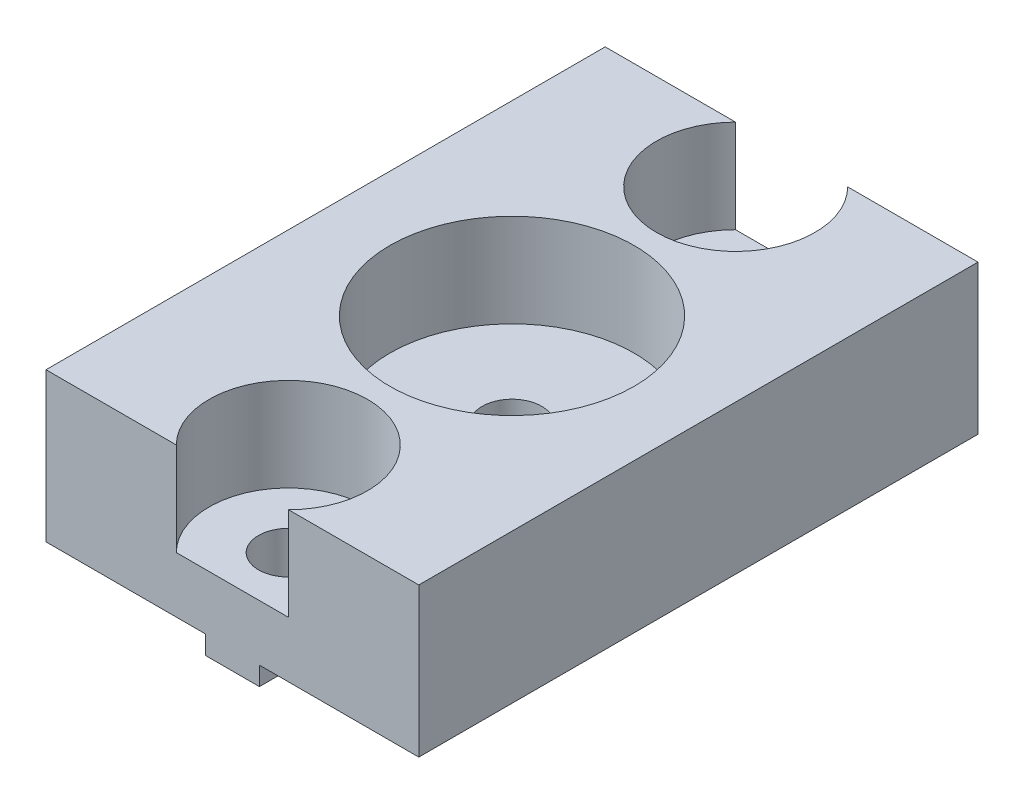
ISO-10303-21;
HEADER;
FILE_DESCRIPTION(('STEP AP214'),'2;1');
FILE_NAME('part.step','',(''),(''),'','','');
FILE_SCHEMA(('AUTOMOTIVE_DESIGN { 1 0 10303 214 1 1 1 1 }'));
ENDSEC;
DATA;
#1=APPLICATION_CONTEXT('core data for automotive mechanical design processes');
#2=APPLICATION_PROTOCOL_DEFINITION('international standard','automotive_design',2000,#1);
#3=PRODUCT_CONTEXT('',#1,'mechanical');
#4=PRODUCT('Part','Part','',(#3));
#5=PRODUCT_RELATED_PRODUCT_CATEGORY('part','',(#4));
#6=PRODUCT_DEFINITION_FORMATION('','',#4);
#7=PRODUCT_DEFINITION_CONTEXT('part definition',#1,'design');
#8=PRODUCT_DEFINITION('design','',#6,#7);
#9=PRODUCT_DEFINITION_SHAPE('','',#8);
#10=(LENGTH_UNIT() NAMED_UNIT(*) SI_UNIT(.MILLI.,.METRE.));
#11=(NAMED_UNIT(*) PLANE_ANGLE_UNIT() SI_UNIT($,.RADIAN.));
#12=(NAMED_UNIT(*) SI_UNIT($,.STERADIAN.) SOLID_ANGLE_UNIT());
#13=UNCERTAINTY_MEASURE_WITH_UNIT(LENGTH_MEASURE(1.E-05),#10,'distance_accuracy_value','');
#14=(GEOMETRIC_REPRESENTATION_CONTEXT(3) GLOBAL_UNCERTAINTY_ASSIGNED_CONTEXT((#13)) GLOBAL_UNIT_ASSIGNED_CONTEXT((#10,
#11,#12)) REPRESENTATION_CONTEXT('',''));
#15=CARTESIAN_POINT('',(0.,0.,0.));
#16=DIRECTION('',(0.,0.,1.));
#17=DIRECTION('',(1.,0.,0.));
#18=AXIS2_PLACEMENT_3D('',#15,#16,#17);
#19=CARTESIAN_POINT('',(0.,9.00000000000001,-12.));
#20=DIRECTION('',(0.,-1.,0.));
#21=DIRECTION('',(1.,0.,0.));
#22=AXIS2_PLACEMENT_3D('',#19,#20,#21);
#23=CYLINDRICAL_SURFACE('',#22,1.6);
#24=CARTESIAN_POINT('',(0.,0.999999999999999,-12.));
#25=DIRECTION('',(0.,1.,0.));
#26=DIRECTION('',(-1.,0.,0.));
#27=AXIS2_PLACEMENT_3D('',#24,#25,#26);
#28=CIRCLE('',#27,1.6);
#29=CARTESIAN_POINT('',(-1.45,0.999999999999999,-12.6763874629234));
#30=VERTEX_POINT('',#29);
#31=CARTESIAN_POINT('',(-1.45,0.999999999999999,-11.3236125370766));
#32=VERTEX_POINT('',#31);
#33=EDGE_CURVE('E377',#30,#32,#28,.T.);
#34=ORIENTED_EDGE('',*,*,#33,.F.);
#35=DIRECTION('',(0.,-1.,0.));
#36=VECTOR('',#35,1.);
#37=CARTESIAN_POINT('',(-1.45,9.00000000000001,-12.6763874629234));
#38=LINE('',#37,#36);
#39=CARTESIAN_POINT('',(-1.45,0.,-12.6763874629234));
#40=VERTEX_POINT('',#39);
#41=EDGE_CURVE('E374',#40,#30,#38,.F.);
#42=ORIENTED_EDGE('',*,*,#41,.F.);
#43=CARTESIAN_POINT('',(0.,0.,-12.));
#44=DIRECTION('',(0.,-1.,0.));
#45=DIRECTION('',(1.,0.,0.));
#46=AXIS2_PLACEMENT_3D('',#43,#44,#45);
#47=CIRCLE('',#46,1.6);
#48=CARTESIAN_POINT('',(1.45,0.,-12.6763874629234));
#49=VERTEX_POINT('',#48);
#50=EDGE_CURVE('E361',#40,#49,#47,.T.);
#51=ORIENTED_EDGE('',*,*,#50,.T.);
#52=DIRECTION('',(0.,-1.,0.));
#53=VECTOR('',#52,1.);
#54=CARTESIAN_POINT('',(1.44999999999999,9.00000000000001,-12.6763874629234));
#55=LINE('',#54,#53);
#56=CARTESIAN_POINT('',(1.45,1.,-12.6763874629234));
#57=VERTEX_POINT('',#56);
#58=EDGE_CURVE('E371',#57,#49,#55,.T.);
#59=ORIENTED_EDGE('',*,*,#58,.F.);
#60=CARTESIAN_POINT('',(0.,0.999999999999999,-12.));
#61=DIRECTION('',(0.,1.,0.));
#62=DIRECTION('',(-1.,0.,0.));
#63=AXIS2_PLACEMENT_3D('',#60,#61,#62);
#64=CIRCLE('',#63,1.6);
#65=CARTESIAN_POINT('',(1.45,1.,-11.3236125370766));
#66=VERTEX_POINT('',#65);
#67=EDGE_CURVE('E365',#66,#57,#64,.T.);
#68=ORIENTED_EDGE('',*,*,#67,.F.);
#69=DIRECTION('',(0.,-1.,0.));
#70=VECTOR('',#69,1.);
#71=CARTESIAN_POINT('',(1.44999999999999,9.00000000000001,-11.3236125370766));
#72=LINE('',#71,#70);
#73=CARTESIAN_POINT('',(1.45,0.,-11.3236125370766));
#74=VERTEX_POINT('',#73);
#75=EDGE_CURVE('E368',#74,#66,#72,.F.);
#76=ORIENTED_EDGE('',*,*,#75,.F.);
#77=CARTESIAN_POINT('',(-1.45,0.,-11.3236125370766));
#78=VERTEX_POINT('',#77);
#79=EDGE_CURVE('E362',#74,#78,#47,.T.);
#80=ORIENTED_EDGE('',*,*,#79,.T.);
#81=DIRECTION('',(0.,-1.,0.));
#82=VECTOR('',#81,1.);
#83=CARTESIAN_POINT('',(-1.45,9.00000000000001,-11.3236125370766));
#84=LINE('',#83,#82);
#85=EDGE_CURVE('E224',#32,#78,#84,.T.);
#86=ORIENTED_EDGE('',*,*,#85,.F.);
#87=EDGE_LOOP('',(#34,#42,#51,#59,#68,#76,#80,#86));
#88=FACE_BOUND('',#87,.T.);
#89=CARTESIAN_POINT('',(0.,4.,-12.));
#90=DIRECTION('',(0.,1.,0.));
#91=DIRECTION('',(-1.,0.,0.));
#92=AXIS2_PLACEMENT_3D('',#89,#90,#91);
#93=CIRCLE('',#92,1.6);
#94=CARTESIAN_POINT('',(-1.6,4.,-12.));
#95=VERTEX_POINT('',#94);
#96=EDGE_CURVE('E287',#95,#95,#93,.F.);
#97=ORIENTED_EDGE('',*,*,#96,.F.);
#98=EDGE_LOOP('',(#97));
#99=FACE_BOUND('',#98,.T.);
#100=ADVANCED_FACE('F33',(#88,#99),#23,.F.);
#101=CARTESIAN_POINT('',(0.,9.00000000000001,12.));
#102=DIRECTION('',(0.,-1.,0.));
#103=DIRECTION('',(1.,0.,0.));
#104=AXIS2_PLACEMENT_3D('',#101,#102,#103);
#105=CYLINDRICAL_SURFACE('',#104,1.6);
#106=CARTESIAN_POINT('',(0.,0.999999999999999,12.));
#107=DIRECTION('',(0.,1.,0.));
#108=DIRECTION('',(-1.,0.,0.));
#109=AXIS2_PLACEMENT_3D('',#106,#107,#108);
#110=CIRCLE('',#109,1.6);
#111=CARTESIAN_POINT('',(-1.45,0.999999999999999,11.3236125370766));
#112=VERTEX_POINT('',#111);
#113=CARTESIAN_POINT('',(-1.45,0.999999999999999,12.6763874629234));
#114=VERTEX_POINT('',#113);
#115=EDGE_CURVE('E352',#112,#114,#110,.T.);
#116=ORIENTED_EDGE('',*,*,#115,.F.);
#117=DIRECTION('',(0.,-1.,0.));
#118=VECTOR('',#117,1.);
#119=CARTESIAN_POINT('',(-1.45,9.00000000000001,11.3236125370766));
#120=LINE('',#119,#118);
#121=CARTESIAN_POINT('',(-1.45,0.,11.3236125370766));
#122=VERTEX_POINT('',#121);
#123=EDGE_CURVE('E355',#122,#112,#120,.F.);
#124=ORIENTED_EDGE('',*,*,#123,.F.);
#125=CARTESIAN_POINT('',(0.,0.,12.));
#126=DIRECTION('',(0.,-1.,0.));
#127=DIRECTION('',(1.,0.,0.));
#128=AXIS2_PLACEMENT_3D('',#125,#126,#127);
#129=CIRCLE('',#128,1.6);
#130=CARTESIAN_POINT('',(1.45,0.,11.3236125370766));
#131=VERTEX_POINT('',#130);
#132=EDGE_CURVE('E323',#122,#131,#129,.T.);
#133=ORIENTED_EDGE('',*,*,#132,.T.);
#134=DIRECTION('',(0.,-1.,0.));
#135=VECTOR('',#134,1.);
#136=CARTESIAN_POINT('',(1.44999999999999,9.00000000000001,11.3236125370766));
#137=LINE('',#136,#135);
#138=CARTESIAN_POINT('',(1.45,1.,11.3236125370766));
#139=VERTEX_POINT('',#138);
#140=EDGE_CURVE('E349',#139,#131,#137,.T.);
#141=ORIENTED_EDGE('',*,*,#140,.F.);
#142=CARTESIAN_POINT('',(0.,0.999999999999999,12.));
#143=DIRECTION('',(0.,1.,0.));
#144=DIRECTION('',(-1.,0.,0.));
#145=AXIS2_PLACEMENT_3D('',#142,#143,#144);
#146=CIRCLE('',#145,1.6);
#147=CARTESIAN_POINT('',(1.45,1.,12.6763874629234));
#148=VERTEX_POINT('',#147);
#149=EDGE_CURVE('E343',#148,#139,#146,.T.);
#150=ORIENTED_EDGE('',*,*,#149,.F.);
#151=DIRECTION('',(0.,-1.,0.));
#152=VECTOR('',#151,1.);
#153=CARTESIAN_POINT('',(1.44999999999999,9.00000000000001,12.6763874629234));
#154=LINE('',#153,#152);
#155=CARTESIAN_POINT('',(1.45,0.,12.6763874629234));
#156=VERTEX_POINT('',#155);
#157=EDGE_CURVE('E346',#156,#148,#154,.F.);
#158=ORIENTED_EDGE('',*,*,#157,.F.);
#159=CARTESIAN_POINT('',(-1.45,0.,12.6763874629234));
#160=VERTEX_POINT('',#159);
#161=EDGE_CURVE('E320',#156,#160,#129,.T.);
#162=ORIENTED_EDGE('',*,*,#161,.T.);
#163=DIRECTION('',(0.,-1.,0.));
#164=VECTOR('',#163,1.);
#165=CARTESIAN_POINT('',(-1.45,9.00000000000001,12.6763874629234));
#166=LINE('',#165,#164);
#167=EDGE_CURVE('E358',#114,#160,#166,.T.);
#168=ORIENTED_EDGE('',*,*,#167,.F.);
#169=EDGE_LOOP('',(#116,#124,#133,#141,#150,#158,#162,#168));
#170=FACE_BOUND('',#169,.T.);
#171=CARTESIAN_POINT('',(0.,4.,12.));
#172=DIRECTION('',(0.,1.,0.));
#173=DIRECTION('',(-1.,0.,0.));
#174=AXIS2_PLACEMENT_3D('',#171,#172,#173);
#175=CIRCLE('',#174,1.6);
#176=CARTESIAN_POINT('',(-1.6,4.,12.));
#177=VERTEX_POINT('',#176);
#178=EDGE_CURVE('E284',#177,#177,#175,.F.);
#179=ORIENTED_EDGE('',*,*,#178,.F.);
#180=EDGE_LOOP('',(#179));
#181=FACE_BOUND('',#180,.T.);
#182=ADVANCED_FACE('F408',(#170,#181),#105,.F.);
#183=CARTESIAN_POINT('',(0.,9.00000000000001,0.));
#184=DIRECTION('',(0.,-1.,0.));
#185=DIRECTION('',(1.,0.,0.));
#186=AXIS2_PLACEMENT_3D('',#183,#184,#185);
#187=CYLINDRICAL_SURFACE('',#186,1.6);
#188=CARTESIAN_POINT('',(0.,0.999999999999999,0.));
#189=DIRECTION('',(0.,1.,0.));
#190=DIRECTION('',(-1.,0.,0.));
#191=AXIS2_PLACEMENT_3D('',#188,#189,#190);
#192=CIRCLE('',#191,1.6);
#193=CARTESIAN_POINT('',(-1.45,0.999999999999999,-0.676387462923435));
#194=VERTEX_POINT('',#193);
#195=CARTESIAN_POINT('',(-1.45,0.999999999999999,0.676387462923435));
#196=VERTEX_POINT('',#195);
#197=EDGE_CURVE('E334',#194,#196,#192,.T.);
#198=ORIENTED_EDGE('',*,*,#197,.F.);
#199=DIRECTION('',(0.,-1.,0.));
#200=VECTOR('',#199,1.);
#201=CARTESIAN_POINT('',(-1.45,9.00000000000001,-0.676387462923445));
#202=LINE('',#201,#200);
#203=CARTESIAN_POINT('',(-1.45,0.,-0.676387462923434));
#204=VERTEX_POINT('',#203);
#205=EDGE_CURVE('E337',#204,#194,#202,.F.);
#206=ORIENTED_EDGE('',*,*,#205,.F.);
#207=CARTESIAN_POINT('',(0.,0.,0.));
#208=DIRECTION('',(0.,-1.,0.));
#209=DIRECTION('',(1.,0.,0.));
#210=AXIS2_PLACEMENT_3D('',#207,#208,#209);
#211=CIRCLE('',#210,1.6);
#212=CARTESIAN_POINT('',(1.45,0.,-0.676387462923434));
#213=VERTEX_POINT('',#212);
#214=EDGE_CURVE('E282',#204,#213,#211,.T.);
#215=ORIENTED_EDGE('',*,*,#214,.T.);
#216=DIRECTION('',(0.,-1.,0.));
#217=VECTOR('',#216,1.);
#218=CARTESIAN_POINT('',(1.44999999999999,9.00000000000001,-0.676387462923441));
#219=LINE('',#218,#217);
#220=CARTESIAN_POINT('',(1.45,1.,-0.676387462923435));
#221=VERTEX_POINT('',#220);
#222=EDGE_CURVE('E331',#221,#213,#219,.T.);
#223=ORIENTED_EDGE('',*,*,#222,.F.);
#224=CARTESIAN_POINT('',(0.,0.999999999999999,0.));
#225=DIRECTION('',(0.,1.,0.));
#226=DIRECTION('',(-1.,0.,0.));
#227=AXIS2_PLACEMENT_3D('',#224,#225,#226);
#228=CIRCLE('',#227,1.6);
#229=CARTESIAN_POINT('',(1.45,1.,0.676387462923435));
#230=VERTEX_POINT('',#229);
#231=EDGE_CURVE('E322',#230,#221,#228,.T.);
#232=ORIENTED_EDGE('',*,*,#231,.F.);
#233=DIRECTION('',(0.,-1.,0.));
#234=VECTOR('',#233,1.);
#235=CARTESIAN_POINT('',(1.44999999999999,9.00000000000001,0.676387462923441));
#236=LINE('',#235,#234);
#237=CARTESIAN_POINT('',(1.45,0.,0.676387462923434));
#238=VERTEX_POINT('',#237);
#239=EDGE_CURVE('E328',#238,#230,#236,.F.);
#240=ORIENTED_EDGE('',*,*,#239,.F.);
#241=CARTESIAN_POINT('',(-1.45,0.,0.676387462923434));
#242=VERTEX_POINT('',#241);
#243=EDGE_CURVE('E324',#238,#242,#211,.T.);
#244=ORIENTED_EDGE('',*,*,#243,.T.);
#245=DIRECTION('',(0.,-1.,0.));
#246=VECTOR('',#245,1.);
#247=CARTESIAN_POINT('',(-1.45,9.00000000000001,0.676387462923445));
#248=LINE('',#247,#246);
#249=EDGE_CURVE('E340',#196,#242,#248,.T.);
#250=ORIENTED_EDGE('',*,*,#249,.F.);
#251=EDGE_LOOP('',(#198,#206,#215,#223,#232,#240,#244,#250));
#252=FACE_BOUND('',#251,.T.);
#253=CARTESIAN_POINT('',(0.,4.,0.));
#254=DIRECTION('',(0.,1.,0.));
#255=DIRECTION('',(-1.,0.,0.));
#256=AXIS2_PLACEMENT_3D('',#253,#254,#255);
#257=CIRCLE('',#256,1.6);
#258=CARTESIAN_POINT('',(-1.6,4.,0.));
#259=VERTEX_POINT('',#258);
#260=EDGE_CURVE('E279',#259,#259,#257,.F.);
#261=ORIENTED_EDGE('',*,*,#260,.F.);
#262=EDGE_LOOP('',(#261));
#263=FACE_BOUND('',#262,.T.);
#264=ADVANCED_FACE('F414',(#252,#263),#187,.F.);
#265=CARTESIAN_POINT('',(-1.45,0.,15.));
#266=DIRECTION('',(1.,0.,0.));
#267=DIRECTION('',(0.,1.,0.));
#268=AXIS2_PLACEMENT_3D('',#265,#266,#267);
#269=PLANE('',#268);
#270=DIRECTION('',(0.,0.,-1.));
#271=VECTOR('',#270,1.);
#272=CARTESIAN_POINT('',(-1.45,1.,15.));
#273=LINE('',#272,#271);
#274=CARTESIAN_POINT('',(-1.45,1.,15.));
#275=VERTEX_POINT('',#274);
#276=EDGE_CURVE('E270',#275,#114,#273,.T.);
#277=ORIENTED_EDGE('',*,*,#276,.T.);
#278=ORIENTED_EDGE('',*,*,#167,.T.);
#279=DIRECTION('',(0.,0.,-1.));
#280=VECTOR('',#279,1.);
#281=CARTESIAN_POINT('',(-1.45,0.,15.));
#282=LINE('',#281,#280);
#283=CARTESIAN_POINT('',(-1.45,0.,15.));
#284=VERTEX_POINT('',#283);
#285=EDGE_CURVE('E264',#284,#160,#282,.T.);
#286=ORIENTED_EDGE('',*,*,#285,.F.);
#287=DIRECTION('',(0.,-1.,0.));
#288=VECTOR('',#287,1.);
#289=CARTESIAN_POINT('',(-1.45,0.,15.));
#290=LINE('',#289,#288);
#291=EDGE_CURVE('E385',#275,#284,#290,.T.);
#292=ORIENTED_EDGE('',*,*,#291,.F.);
#293=EDGE_LOOP('',(#277,#278,#286,#292));
#294=FACE_BOUND('',#293,.T.);
#295=ADVANCED_FACE('F497',(#294),#269,.F.);
#296=EDGE_CURVE('E268',#122,#242,#282,.T.);
#297=ORIENTED_EDGE('',*,*,#296,.F.);
#298=ORIENTED_EDGE('',*,*,#123,.T.);
#299=EDGE_CURVE('E274',#112,#196,#273,.T.);
#300=ORIENTED_EDGE('',*,*,#299,.T.);
#301=ORIENTED_EDGE('',*,*,#249,.T.);
#302=EDGE_LOOP('',(#297,#298,#300,#301));
#303=FACE_BOUND('',#302,.T.);
#304=ADVANCED_FACE('F506',(#303),#269,.F.);
#305=CARTESIAN_POINT('',(1.45,0.,15.));
#306=DIRECTION('',(0.,1.,0.));
#307=DIRECTION('',(-1.,0.,0.));
#308=AXIS2_PLACEMENT_3D('',#305,#306,#307);
#309=PLANE('',#308);
#310=ORIENTED_EDGE('',*,*,#285,.T.);
#311=ORIENTED_EDGE('',*,*,#161,.F.);
#312=DIRECTION('',(0.,0.,-1.));
#313=VECTOR('',#312,1.);
#314=CARTESIAN_POINT('',(1.45,0.,15.));
#315=LINE('',#314,#313);
#316=CARTESIAN_POINT('',(1.45,0.,15.));
#317=VERTEX_POINT('',#316);
#318=EDGE_CURVE('E258',#317,#156,#315,.T.);
#319=ORIENTED_EDGE('',*,*,#318,.F.);
#320=DIRECTION('',(1.,0.,0.));
#321=VECTOR('',#320,1.);
#322=CARTESIAN_POINT('',(1.45,0.,15.));
#323=LINE('',#322,#321);
#324=EDGE_CURVE('E387',#284,#317,#323,.T.);
#325=ORIENTED_EDGE('',*,*,#324,.F.);
#326=EDGE_LOOP('',(#310,#311,#319,#325));
#327=FACE_BOUND('',#326,.T.);
#328=ADVANCED_FACE('F516',(#327),#309,.F.);
#329=EDGE_CURVE('E262',#131,#238,#315,.T.);
#330=ORIENTED_EDGE('',*,*,#329,.F.);
#331=ORIENTED_EDGE('',*,*,#132,.F.);
#332=ORIENTED_EDGE('',*,*,#296,.T.);
#333=ORIENTED_EDGE('',*,*,#243,.F.);
#334=EDGE_LOOP('',(#330,#331,#332,#333));
#335=FACE_BOUND('',#334,.T.);
#336=ADVANCED_FACE('F525',(#335),#309,.F.);
#337=CARTESIAN_POINT('',(1.45,1.,15.));
#338=DIRECTION('',(-1.,0.,0.));
#339=DIRECTION('',(0.,-1.,0.));
#340=AXIS2_PLACEMENT_3D('',#337,#338,#339);
#341=PLANE('',#340);
#342=DIRECTION('',(0.,0.,-1.));
#343=VECTOR('',#342,1.);
#344=CARTESIAN_POINT('',(1.45,1.,15.));
#345=LINE('',#344,#343);
#346=EDGE_CURVE('E256',#139,#230,#345,.T.);
#347=ORIENTED_EDGE('',*,*,#346,.F.);
#348=ORIENTED_EDGE('',*,*,#140,.T.);
#349=ORIENTED_EDGE('',*,*,#329,.T.);
#350=ORIENTED_EDGE('',*,*,#239,.T.);
#351=EDGE_LOOP('',(#347,#348,#349,#350));
#352=FACE_BOUND('',#351,.T.);
#353=ADVANCED_FACE('F535',(#352),#341,.F.);
#354=EDGE_CURVE('E257',#221,#66,#345,.T.);
#355=ORIENTED_EDGE('',*,*,#354,.F.);
#356=ORIENTED_EDGE('',*,*,#222,.T.);
#357=EDGE_CURVE('E263',#213,#74,#315,.T.);
#358=ORIENTED_EDGE('',*,*,#357,.T.);
#359=ORIENTED_EDGE('',*,*,#75,.T.);
#360=EDGE_LOOP('',(#355,#356,#358,#359));
#361=FACE_BOUND('',#360,.T.);
#362=ADVANCED_FACE('F544',(#361),#341,.F.);
#363=EDGE_CURVE('E269',#204,#78,#282,.T.);
#364=ORIENTED_EDGE('',*,*,#363,.F.);
#365=ORIENTED_EDGE('',*,*,#205,.T.);
#366=EDGE_CURVE('E275',#194,#32,#273,.T.);
#367=ORIENTED_EDGE('',*,*,#366,.T.);
#368=ORIENTED_EDGE('',*,*,#85,.T.);
#369=EDGE_LOOP('',(#364,#365,#367,#368));
#370=FACE_BOUND('',#369,.T.);
#371=ADVANCED_FACE('F518',(#370),#269,.F.);
#372=ORIENTED_EDGE('',*,*,#357,.F.);
#373=ORIENTED_EDGE('',*,*,#214,.F.);
#374=ORIENTED_EDGE('',*,*,#363,.T.);
#375=ORIENTED_EDGE('',*,*,#79,.F.);
#376=EDGE_LOOP('',(#372,#373,#374,#375));
#377=FACE_BOUND('',#376,.T.);
#378=ADVANCED_FACE('F537',(#377),#309,.F.);
#379=CARTESIAN_POINT('',(1.45,1.,-15.));
#380=VERTEX_POINT('',#379);
#381=EDGE_CURVE('E251',#57,#380,#345,.T.);
#382=ORIENTED_EDGE('',*,*,#381,.F.);
#383=ORIENTED_EDGE('',*,*,#58,.T.);
#384=CARTESIAN_POINT('',(1.45,0.,-15.));
#385=VERTEX_POINT('',#384);
#386=EDGE_CURVE('E255',#49,#385,#315,.T.);
#387=ORIENTED_EDGE('',*,*,#386,.T.);
#388=DIRECTION('',(0.,1.,0.));
#389=VECTOR('',#388,1.);
#390=CARTESIAN_POINT('',(1.45,1.,-15.));
#391=LINE('',#390,#389);
#392=EDGE_CURVE('E233',#385,#380,#391,.T.);
#393=ORIENTED_EDGE('',*,*,#392,.T.);
#394=EDGE_LOOP('',(#382,#383,#387,#393));
#395=FACE_BOUND('',#394,.T.);
#396=ADVANCED_FACE('F554',(#395),#341,.F.);
#397=CARTESIAN_POINT('',(-10.,0.999999999999999,15.));
#398=DIRECTION('',(1.,0.,0.));
#399=DIRECTION('',(0.,1.,0.));
#400=AXIS2_PLACEMENT_3D('',#397,#398,#399);
#401=PLANE('',#400);
#402=DIRECTION('',(0.,-1.,0.));
#403=VECTOR('',#402,1.);
#404=CARTESIAN_POINT('',(-10.,0.999999999999999,-15.));
#405=LINE('',#404,#403);
#406=CARTESIAN_POINT('',(-10.,9.,-15.));
#407=VERTEX_POINT('',#406);
#408=CARTESIAN_POINT('',(-10.,0.999999999999999,-15.));
#409=VERTEX_POINT('',#408);
#410=EDGE_CURVE('E220',#407,#409,#405,.T.);
#411=ORIENTED_EDGE('',*,*,#410,.T.);
#412=DIRECTION('',(0.,0.,-1.));
#413=VECTOR('',#412,1.);
#414=CARTESIAN_POINT('',(-10.,0.999999999999999,15.));
#415=LINE('',#414,#413);
#416=CARTESIAN_POINT('',(-10.,0.999999999999999,15.));
#417=VERTEX_POINT('',#416);
#418=EDGE_CURVE('E273',#417,#409,#415,.T.);
#419=ORIENTED_EDGE('',*,*,#418,.F.);
#420=DIRECTION('',(0.,-1.,0.));
#421=VECTOR('',#420,1.);
#422=CARTESIAN_POINT('',(-10.,0.999999999999999,15.));
#423=LINE('',#422,#421);
#424=CARTESIAN_POINT('',(-10.,9.,15.));
#425=VERTEX_POINT('',#424);
#426=EDGE_CURVE('E243',#425,#417,#423,.T.);
#427=ORIENTED_EDGE('',*,*,#426,.F.);
#428=DIRECTION('',(0.,0.,-1.));
#429=VECTOR('',#428,1.);
#430=CARTESIAN_POINT('',(-10.,9.,15.));
#431=LINE('',#430,#429);
#432=EDGE_CURVE('E211',#425,#407,#431,.T.);
#433=ORIENTED_EDGE('',*,*,#432,.T.);
#434=EDGE_LOOP('',(#411,#419,#427,#433));
#435=FACE_BOUND('',#434,.T.);
#436=ADVANCED_FACE('F35',(#435),#401,.F.);
#437=CARTESIAN_POINT('',(-1.45,1.,15.));
#438=DIRECTION('',(0.,1.,0.));
#439=DIRECTION('',(-1.,0.,0.));
#440=AXIS2_PLACEMENT_3D('',#437,#438,#439);
#441=PLANE('',#440);
#442=ORIENTED_EDGE('',*,*,#299,.F.);
#443=ORIENTED_EDGE('',*,*,#115,.T.);
#444=ORIENTED_EDGE('',*,*,#276,.F.);
#445=DIRECTION('',(1.,0.,0.));
#446=VECTOR('',#445,1.);
#447=CARTESIAN_POINT('',(-1.45,1.,15.));
#448=LINE('',#447,#446);
#449=EDGE_CURVE('E383',#417,#275,#448,.T.);
#450=ORIENTED_EDGE('',*,*,#449,.F.);
#451=ORIENTED_EDGE('',*,*,#418,.T.);
#452=DIRECTION('',(1.,0.,0.));
#453=VECTOR('',#452,1.);
#454=CARTESIAN_POINT('',(-1.45,1.,-15.));
#455=LINE('',#454,#453);
#456=CARTESIAN_POINT('',(-1.45,1.,-15.));
#457=VERTEX_POINT('',#456);
#458=EDGE_CURVE('E223',#409,#457,#455,.T.);
#459=ORIENTED_EDGE('',*,*,#458,.T.);
#460=EDGE_CURVE('E267',#30,#457,#273,.T.);
#461=ORIENTED_EDGE('',*,*,#460,.F.);
#462=ORIENTED_EDGE('',*,*,#33,.T.);
#463=ORIENTED_EDGE('',*,*,#366,.F.);
#464=ORIENTED_EDGE('',*,*,#197,.T.);
#465=EDGE_LOOP('',(#442,#443,#444,#450,#451,#459,#461,#462,#463,#464));
#466=FACE_BOUND('',#465,.T.);
#467=ADVANCED_FACE('F619',(#466),#441,.F.);
#468=CARTESIAN_POINT('',(-1.45,0.,-15.));
#469=VERTEX_POINT('',#468);
#470=EDGE_CURVE('E261',#40,#469,#282,.T.);
#471=ORIENTED_EDGE('',*,*,#470,.F.);
#472=ORIENTED_EDGE('',*,*,#41,.T.);
#473=ORIENTED_EDGE('',*,*,#460,.T.);
#474=DIRECTION('',(0.,-1.,0.));
#475=VECTOR('',#474,1.);
#476=CARTESIAN_POINT('',(-1.45,0.,-15.));
#477=LINE('',#476,#475);
#478=EDGE_CURVE('E227',#457,#469,#477,.T.);
#479=ORIENTED_EDGE('',*,*,#478,.T.);
#480=EDGE_LOOP('',(#471,#472,#473,#479));
#481=FACE_BOUND('',#480,.T.);
#482=ADVANCED_FACE('F509',(#481),#269,.F.);
#483=ORIENTED_EDGE('',*,*,#386,.F.);
#484=ORIENTED_EDGE('',*,*,#50,.F.);
#485=ORIENTED_EDGE('',*,*,#470,.T.);
#486=DIRECTION('',(1.,0.,0.));
#487=VECTOR('',#486,1.);
#488=CARTESIAN_POINT('',(1.45,0.,-15.));
#489=LINE('',#488,#487);
#490=EDGE_CURVE('E230',#469,#385,#489,.T.);
#491=ORIENTED_EDGE('',*,*,#490,.T.);
#492=EDGE_LOOP('',(#483,#484,#485,#491));
#493=FACE_BOUND('',#492,.T.);
#494=ADVANCED_FACE('F528',(#493),#309,.F.);
#495=ORIENTED_EDGE('',*,*,#318,.T.);
#496=ORIENTED_EDGE('',*,*,#157,.T.);
#497=CARTESIAN_POINT('',(1.45,1.,15.));
#498=VERTEX_POINT('',#497);
#499=EDGE_CURVE('E252',#498,#148,#345,.T.);
#500=ORIENTED_EDGE('',*,*,#499,.F.);
#501=DIRECTION('',(0.,1.,0.));
#502=VECTOR('',#501,1.);
#503=CARTESIAN_POINT('',(1.45,1.,15.));
#504=LINE('',#503,#502);
#505=EDGE_CURVE('E389',#317,#498,#504,.T.);
#506=ORIENTED_EDGE('',*,*,#505,.F.);
#507=EDGE_LOOP('',(#495,#496,#500,#506));
#508=FACE_BOUND('',#507,.T.);
#509=ADVANCED_FACE('F405',(#508),#341,.F.);
#510=CARTESIAN_POINT('',(10.,1.,15.));
#511=DIRECTION('',(0.,1.,0.));
#512=DIRECTION('',(-1.,0.,0.));
#513=AXIS2_PLACEMENT_3D('',#510,#511,#512);
#514=PLANE('',#513);
#515=ORIENTED_EDGE('',*,*,#499,.T.);
#516=ORIENTED_EDGE('',*,*,#149,.T.);
#517=ORIENTED_EDGE('',*,*,#346,.T.);
#518=ORIENTED_EDGE('',*,*,#231,.T.);
#519=ORIENTED_EDGE('',*,*,#354,.T.);
#520=ORIENTED_EDGE('',*,*,#67,.T.);
#521=ORIENTED_EDGE('',*,*,#381,.T.);
#522=DIRECTION('',(1.,0.,0.));
#523=VECTOR('',#522,1.);
#524=CARTESIAN_POINT('',(10.,1.,-15.));
#525=LINE('',#524,#523);
#526=CARTESIAN_POINT('',(10.,1.,-15.));
#527=VERTEX_POINT('',#526);
#528=EDGE_CURVE('E236',#380,#527,#525,.T.);
#529=ORIENTED_EDGE('',*,*,#528,.T.);
#530=DIRECTION('',(0.,0.,-1.));
#531=VECTOR('',#530,1.);
#532=CARTESIAN_POINT('',(10.,1.,15.));
#533=LINE('',#532,#531);
#534=CARTESIAN_POINT('',(10.,1.,15.));
#535=VERTEX_POINT('',#534);
#536=EDGE_CURVE('E248',#535,#527,#533,.T.);
#537=ORIENTED_EDGE('',*,*,#536,.F.);
#538=DIRECTION('',(1.,0.,0.));
#539=VECTOR('',#538,1.);
#540=CARTESIAN_POINT('',(10.,1.,15.));
#541=LINE('',#540,#539);
#542=EDGE_CURVE('E216',#498,#535,#541,.T.);
#543=ORIENTED_EDGE('',*,*,#542,.F.);
#544=EDGE_LOOP('',(#515,#516,#517,#518,#519,#520,#521,#529,#537,#543));
#545=FACE_BOUND('',#544,.T.);
#546=ADVANCED_FACE('F395',(#545),#514,.F.);
#547=CARTESIAN_POINT('',(10.,9.00000000000001,15.));
#548=DIRECTION('',(-1.,0.,0.));
#549=DIRECTION('',(0.,-1.,0.));
#550=AXIS2_PLACEMENT_3D('',#547,#548,#549);
#551=PLANE('',#550);
#552=DIRECTION('',(0.,1.,0.));
#553=VECTOR('',#552,1.);
#554=CARTESIAN_POINT('',(10.,9.00000000000001,-15.));
#555=LINE('',#554,#553);
#556=CARTESIAN_POINT('',(10.,9.00000000000001,-15.));
#557=VERTEX_POINT('',#556);
#558=EDGE_CURVE('E238',#527,#557,#555,.T.);
#559=ORIENTED_EDGE('',*,*,#558,.T.);
#560=DIRECTION('',(0.,0.,-1.));
#561=VECTOR('',#560,1.);
#562=CARTESIAN_POINT('',(10.,9.00000000000001,15.));
#563=LINE('',#562,#561);
#564=CARTESIAN_POINT('',(10.,9.00000000000001,15.));
#565=VERTEX_POINT('',#564);
#566=EDGE_CURVE('E245',#565,#557,#563,.T.);
#567=ORIENTED_EDGE('',*,*,#566,.F.);
#568=DIRECTION('',(0.,1.,0.));
#569=VECTOR('',#568,1.);
#570=CARTESIAN_POINT('',(10.,9.00000000000001,15.));
#571=LINE('',#570,#569);
#572=EDGE_CURVE('E214',#535,#565,#571,.T.);
#573=ORIENTED_EDGE('',*,*,#572,.F.);
#574=ORIENTED_EDGE('',*,*,#536,.T.);
#575=EDGE_LOOP('',(#559,#567,#573,#574));
#576=FACE_BOUND('',#575,.T.);
#577=ADVANCED_FACE('F396',(#576),#551,.F.);
#578=CARTESIAN_POINT('',(-10.,9.,15.));
#579=DIRECTION('',(0.,-1.,0.));
#580=DIRECTION('',(1.,0.,0.));
#581=AXIS2_PLACEMENT_3D('',#578,#579,#580);
#582=PLANE('',#581);
#583=CARTESIAN_POINT('',(0.,9.,0.));
#584=DIRECTION('',(0.,1.,0.));
#585=DIRECTION('',(-1.,0.,0.));
#586=AXIS2_PLACEMENT_3D('',#583,#584,#585);
#587=CIRCLE('',#586,6.55);
#588=CARTESIAN_POINT('',(-6.55,9.,0.));
#589=VERTEX_POINT('',#588);
#590=EDGE_CURVE('E315',#589,#589,#587,.T.);
#591=ORIENTED_EDGE('',*,*,#590,.F.);
#592=EDGE_LOOP('',(#591));
#593=FACE_BOUND('',#592,.T.);
#594=DIRECTION('',(-1.,0.,0.));
#595=VECTOR('',#594,1.);
#596=CARTESIAN_POINT('',(-10.,9.,-15.));
#597=LINE('',#596,#595);
#598=CARTESIAN_POINT('',(3.01039864469807,9.,-15.));
#599=VERTEX_POINT('',#598);
#600=EDGE_CURVE('E241',#557,#599,#597,.T.);
#601=ORIENTED_EDGE('',*,*,#600,.T.);
#602=CARTESIAN_POINT('',(0.,9.,-12.));
#603=DIRECTION('',(0.,1.,0.));
#604=DIRECTION('',(-1.,0.,0.));
#605=AXIS2_PLACEMENT_3D('',#602,#603,#604);
#606=CIRCLE('',#605,4.25);
#607=CARTESIAN_POINT('',(-3.01039864469808,9.,-15.));
#608=VERTEX_POINT('',#607);
#609=EDGE_CURVE('E307',#608,#599,#606,.T.);
#610=ORIENTED_EDGE('',*,*,#609,.F.);
#611=EDGE_CURVE('E240',#608,#407,#597,.T.);
#612=ORIENTED_EDGE('',*,*,#611,.T.);
#613=ORIENTED_EDGE('',*,*,#432,.F.);
#614=DIRECTION('',(-1.,0.,0.));
#615=VECTOR('',#614,1.);
#616=CARTESIAN_POINT('',(-10.,9.,15.));
#617=LINE('',#616,#615);
#618=CARTESIAN_POINT('',(-3.01039864469808,9.,15.));
#619=VERTEX_POINT('',#618);
#620=EDGE_CURVE('E205',#619,#425,#617,.T.);
#621=ORIENTED_EDGE('',*,*,#620,.F.);
#622=CARTESIAN_POINT('',(0.,9.,12.));
#623=DIRECTION('',(0.,1.,0.));
#624=DIRECTION('',(-1.,0.,0.));
#625=AXIS2_PLACEMENT_3D('',#622,#623,#624);
#626=CIRCLE('',#625,4.25);
#627=CARTESIAN_POINT('',(3.01039864469807,9.,15.));
#628=VERTEX_POINT('',#627);
#629=EDGE_CURVE('E193',#628,#619,#626,.T.);
#630=ORIENTED_EDGE('',*,*,#629,.F.);
#631=EDGE_CURVE('E213',#565,#628,#617,.T.);
#632=ORIENTED_EDGE('',*,*,#631,.F.);
#633=ORIENTED_EDGE('',*,*,#566,.T.);
#634=EDGE_LOOP('',(#601,#610,#612,#613,#621,#630,#632,#633));
#635=FACE_BOUND('',#634,.T.);
#636=ADVANCED_FACE('F209',(#593,#635),#582,.F.);
#637=CARTESIAN_POINT('',(0.,0.,15.));
#638=DIRECTION('',(0.,0.,-1.));
#639=DIRECTION('',(-1.,0.,0.));
#640=AXIS2_PLACEMENT_3D('',#637,#638,#639);
#641=PLANE('',#640);
#642=DIRECTION('',(1.,0.,0.));
#643=VECTOR('',#642,1.);
#644=CARTESIAN_POINT('',(0.,4.,15.));
#645=LINE('',#644,#643);
#646=CARTESIAN_POINT('',(-3.01039864469807,4.,15.));
#647=VERTEX_POINT('',#646);
#648=CARTESIAN_POINT('',(3.01039864469807,4.,15.));
#649=VERTEX_POINT('',#648);
#650=EDGE_CURVE('E207',#647,#649,#645,.T.);
#651=ORIENTED_EDGE('',*,*,#650,.F.);
#652=DIRECTION('',(0.,1.,0.));
#653=VECTOR('',#652,1.);
#654=CARTESIAN_POINT('',(-3.01039864469807,4.,15.));
#655=LINE('',#654,#653);
#656=EDGE_CURVE('E11',#647,#619,#655,.T.);
#657=ORIENTED_EDGE('',*,*,#656,.T.);
#658=ORIENTED_EDGE('',*,*,#620,.T.);
#659=ORIENTED_EDGE('',*,*,#426,.T.);
#660=ORIENTED_EDGE('',*,*,#449,.T.);
#661=ORIENTED_EDGE('',*,*,#291,.T.);
#662=ORIENTED_EDGE('',*,*,#324,.T.);
#663=ORIENTED_EDGE('',*,*,#505,.T.);
#664=ORIENTED_EDGE('',*,*,#542,.T.);
#665=ORIENTED_EDGE('',*,*,#572,.T.);
#666=ORIENTED_EDGE('',*,*,#631,.T.);
#667=DIRECTION('',(0.,1.,0.));
#668=VECTOR('',#667,1.);
#669=CARTESIAN_POINT('',(3.01039864469807,4.,15.));
#670=LINE('',#669,#668);
#671=EDGE_CURVE('E41',#628,#649,#670,.F.);
#672=ORIENTED_EDGE('',*,*,#671,.T.);
#673=EDGE_LOOP('',(#651,#657,#658,#659,#660,#661,#662,#663,#664,#665,#666,#672));
#674=FACE_BOUND('',#673,.T.);
#675=ADVANCED_FACE('F203',(#674),#641,.F.);
#676=CARTESIAN_POINT('',(0.,0.,-15.));
#677=DIRECTION('',(0.,0.,-1.));
#678=DIRECTION('',(-1.,0.,0.));
#679=AXIS2_PLACEMENT_3D('',#676,#677,#678);
#680=PLANE('',#679);
#681=DIRECTION('',(0.,1.,0.));
#682=VECTOR('',#681,1.);
#683=CARTESIAN_POINT('',(-3.01039864469807,4.,-15.));
#684=LINE('',#683,#682);
#685=CARTESIAN_POINT('',(-3.01039864469807,4.,-15.));
#686=VERTEX_POINT('',#685);
#687=EDGE_CURVE('E292',#686,#608,#684,.T.);
#688=ORIENTED_EDGE('',*,*,#687,.F.);
#689=DIRECTION('',(1.,0.,0.));
#690=VECTOR('',#689,1.);
#691=CARTESIAN_POINT('',(0.,4.,-15.));
#692=LINE('',#691,#690);
#693=CARTESIAN_POINT('',(3.01039864469807,4.,-15.));
#694=VERTEX_POINT('',#693);
#695=EDGE_CURVE('E290',#686,#694,#692,.T.);
#696=ORIENTED_EDGE('',*,*,#695,.T.);
#697=DIRECTION('',(0.,1.,0.));
#698=VECTOR('',#697,1.);
#699=CARTESIAN_POINT('',(3.01039864469807,4.,-15.));
#700=LINE('',#699,#698);
#701=EDGE_CURVE('E278',#599,#694,#700,.F.);
#702=ORIENTED_EDGE('',*,*,#701,.F.);
#703=ORIENTED_EDGE('',*,*,#600,.F.);
#704=ORIENTED_EDGE('',*,*,#558,.F.);
#705=ORIENTED_EDGE('',*,*,#528,.F.);
#706=ORIENTED_EDGE('',*,*,#392,.F.);
#707=ORIENTED_EDGE('',*,*,#490,.F.);
#708=ORIENTED_EDGE('',*,*,#478,.F.);
#709=ORIENTED_EDGE('',*,*,#458,.F.);
#710=ORIENTED_EDGE('',*,*,#410,.F.);
#711=ORIENTED_EDGE('',*,*,#611,.F.);
#712=EDGE_LOOP('',(#688,#696,#702,#703,#704,#705,#706,#707,#708,#709,#710,#711));
#713=FACE_BOUND('',#712,.T.);
#714=ADVANCED_FACE('F302',(#713),#680,.T.);
#715=CARTESIAN_POINT('',(0.,4.,0.));
#716=DIRECTION('',(0.,1.,0.));
#717=DIRECTION('',(-1.,0.,0.));
#718=AXIS2_PLACEMENT_3D('',#715,#716,#717);
#719=PLANE('',#718);
#720=CARTESIAN_POINT('',(0.,4.,0.));
#721=DIRECTION('',(0.,1.,0.));
#722=DIRECTION('',(-1.,0.,0.));
#723=AXIS2_PLACEMENT_3D('',#720,#721,#722);
#724=CIRCLE('',#723,6.55);
#725=CARTESIAN_POINT('',(-6.55,4.,0.));
#726=VERTEX_POINT('',#725);
#727=EDGE_CURVE('E283',#726,#726,#724,.T.);
#728=ORIENTED_EDGE('',*,*,#727,.T.);
#729=EDGE_LOOP('',(#728));
#730=FACE_BOUND('',#729,.T.);
#731=ORIENTED_EDGE('',*,*,#260,.T.);
#732=EDGE_LOOP('',(#731));
#733=FACE_BOUND('',#732,.T.);
#734=ADVANCED_FACE('F423',(#730,#733),#719,.T.);
#735=CARTESIAN_POINT('',(0.,4.,0.));
#736=DIRECTION('',(0.,1.,0.));
#737=DIRECTION('',(-1.,0.,0.));
#738=AXIS2_PLACEMENT_3D('',#735,#736,#737);
#739=CYLINDRICAL_SURFACE('',#738,6.55);
#740=ORIENTED_EDGE('',*,*,#727,.F.);
#741=EDGE_LOOP('',(#740));
#742=FACE_BOUND('',#741,.T.);
#743=ORIENTED_EDGE('',*,*,#590,.T.);
#744=EDGE_LOOP('',(#743));
#745=FACE_BOUND('',#744,.T.);
#746=ADVANCED_FACE('F427',(#742,#745),#739,.F.);
#747=CARTESIAN_POINT('',(0.,4.,12.));
#748=DIRECTION('',(0.,1.,0.));
#749=DIRECTION('',(-1.,0.,0.));
#750=AXIS2_PLACEMENT_3D('',#747,#748,#749);
#751=CYLINDRICAL_SURFACE('',#750,4.25);
#752=CARTESIAN_POINT('',(0.,4.,12.));
#753=DIRECTION('',(0.,1.,0.));
#754=DIRECTION('',(-1.,0.,0.));
#755=AXIS2_PLACEMENT_3D('',#752,#753,#754);
#756=CIRCLE('',#755,4.25);
#757=EDGE_CURVE('E47',#649,#647,#756,.T.);
#758=ORIENTED_EDGE('',*,*,#757,.F.);
#759=ORIENTED_EDGE('',*,*,#671,.F.);
#760=ORIENTED_EDGE('',*,*,#629,.T.);
#761=ORIENTED_EDGE('',*,*,#656,.F.);
#762=EDGE_LOOP('',(#758,#759,#760,#761));
#763=FACE_BOUND('',#762,.T.);
#764=ADVANCED_FACE('F194',(#763),#751,.F.);
#765=CARTESIAN_POINT('',(0.,4.,12.));
#766=DIRECTION('',(0.,1.,0.));
#767=DIRECTION('',(-1.,0.,0.));
#768=AXIS2_PLACEMENT_3D('',#765,#766,#767);
#769=PLANE('',#768);
#770=ORIENTED_EDGE('',*,*,#178,.T.);
#771=EDGE_LOOP('',(#770));
#772=FACE_BOUND('',#771,.T.);
#773=ORIENTED_EDGE('',*,*,#650,.T.);
#774=ORIENTED_EDGE('',*,*,#757,.T.);
#775=EDGE_LOOP('',(#773,#774));
#776=FACE_BOUND('',#775,.T.);
#777=ADVANCED_FACE('F439',(#772,#776),#769,.T.);
#778=CARTESIAN_POINT('',(0.,4.,-12.));
#779=DIRECTION('',(0.,1.,0.));
#780=DIRECTION('',(-1.,0.,0.));
#781=AXIS2_PLACEMENT_3D('',#778,#779,#780);
#782=PLANE('',#781);
#783=CARTESIAN_POINT('',(0.,4.,-12.));
#784=DIRECTION('',(0.,1.,0.));
#785=DIRECTION('',(-1.,0.,0.));
#786=AXIS2_PLACEMENT_3D('',#783,#784,#785);
#787=CIRCLE('',#786,4.25);
#788=EDGE_CURVE('E54',#686,#694,#787,.T.);
#789=ORIENTED_EDGE('',*,*,#788,.T.);
#790=ORIENTED_EDGE('',*,*,#695,.F.);
#791=EDGE_LOOP('',(#789,#790));
#792=FACE_BOUND('',#791,.T.);
#793=ORIENTED_EDGE('',*,*,#96,.T.);
#794=EDGE_LOOP('',(#793));
#795=FACE_BOUND('',#794,.T.);
#796=ADVANCED_FACE('F442',(#792,#795),#782,.T.);
#797=CARTESIAN_POINT('',(0.,4.,-12.));
#798=DIRECTION('',(0.,1.,0.));
#799=DIRECTION('',(-1.,0.,0.));
#800=AXIS2_PLACEMENT_3D('',#797,#798,#799);
#801=CYLINDRICAL_SURFACE('',#800,4.25);
#802=ORIENTED_EDGE('',*,*,#687,.T.);
#803=ORIENTED_EDGE('',*,*,#609,.T.);
#804=ORIENTED_EDGE('',*,*,#701,.T.);
#805=ORIENTED_EDGE('',*,*,#788,.F.);
#806=EDGE_LOOP('',(#802,#803,#804,#805));
#807=FACE_BOUND('',#806,.T.);
#808=ADVANCED_FACE('F306',(#807),#801,.F.);
#809=CLOSED_SHELL('',(#100,#182,#264,#295,#304,#328,#336,#353,#362,#371,#378,#396,#436,#467,
#482,#494,#509,#546,#577,#636,#675,#714,#734,#746,#764,#777,#796,#808));
#810=MANIFOLD_SOLID_BREP('B2',#809);
#811=ADVANCED_BREP_SHAPE_REPRESENTATION('',(#18,#810),#14);
#812=SHAPE_DEFINITION_REPRESENTATION(#9,#811);
ENDSEC;
END-ISO-10303-21;
